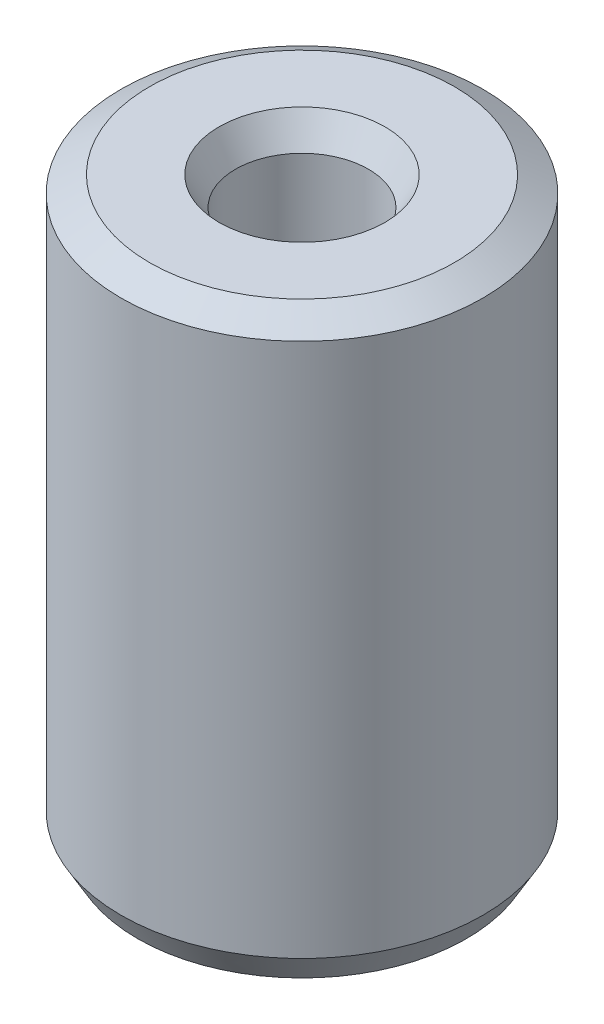
ISO-10303-21;
HEADER;
FILE_DESCRIPTION(('STEP AP214'),'2;1');
FILE_NAME('part.step','',(''),(''),'','','');
FILE_SCHEMA(('AUTOMOTIVE_DESIGN { 1 0 10303 214 1 1 1 1 }'));
ENDSEC;
DATA;
#1=APPLICATION_CONTEXT('core data for automotive mechanical design processes');
#2=APPLICATION_PROTOCOL_DEFINITION('international standard','automotive_design',2000,#1);
#3=PRODUCT_CONTEXT('',#1,'mechanical');
#4=PRODUCT('Part','Part','',(#3));
#5=PRODUCT_RELATED_PRODUCT_CATEGORY('part','',(#4));
#6=PRODUCT_DEFINITION_FORMATION('','',#4);
#7=PRODUCT_DEFINITION_CONTEXT('part definition',#1,'design');
#8=PRODUCT_DEFINITION('design','',#6,#7);
#9=PRODUCT_DEFINITION_SHAPE('','',#8);
#10=(LENGTH_UNIT() NAMED_UNIT(*) SI_UNIT(.MILLI.,.METRE.));
#11=(NAMED_UNIT(*) PLANE_ANGLE_UNIT() SI_UNIT($,.RADIAN.));
#12=(NAMED_UNIT(*) SI_UNIT($,.STERADIAN.) SOLID_ANGLE_UNIT());
#13=UNCERTAINTY_MEASURE_WITH_UNIT(LENGTH_MEASURE(1.E-05),#10,'distance_accuracy_value','');
#14=(GEOMETRIC_REPRESENTATION_CONTEXT(3) GLOBAL_UNCERTAINTY_ASSIGNED_CONTEXT((#13)) GLOBAL_UNIT_ASSIGNED_CONTEXT((#10,
#11,#12)) REPRESENTATION_CONTEXT('',''));
#15=CARTESIAN_POINT('',(0.,0.,0.));
#16=DIRECTION('',(0.,0.,1.));
#17=DIRECTION('',(1.,0.,0.));
#18=AXIS2_PLACEMENT_3D('',#15,#16,#17);
#19=CARTESIAN_POINT('',(0.,64.048340345503,0.));
#20=DIRECTION('',(0.,-1.,0.));
#21=DIRECTION('',(0.,0.,-1.));
#22=AXIS2_PLACEMENT_3D('',#19,#20,#21);
#23=CYLINDRICAL_SURFACE('',#22,20.);
#24=CARTESIAN_POINT('',(0.,3.14994997063316,0.));
#25=DIRECTION('',(0.,1.,0.));
#26=DIRECTION('',(0.,0.,1.));
#27=AXIS2_PLACEMENT_3D('',#24,#25,#26);
#28=CIRCLE('',#27,20.);
#29=CARTESIAN_POINT('',(0.,3.14994997063316,20.));
#30=VERTEX_POINT('',#29);
#31=EDGE_CURVE('E10',#30,#30,#28,.T.);
#32=ORIENTED_EDGE('',*,*,#31,.T.);
#33=EDGE_LOOP('',(#32));
#34=FACE_BOUND('',#33,.T.);
#35=CARTESIAN_POINT('',(0.,62.2297158820241,0.));
#36=DIRECTION('',(0.,1.,0.));
#37=DIRECTION('',(0.,0.,1.));
#38=AXIS2_PLACEMENT_3D('',#35,#36,#37);
#39=CIRCLE('',#38,20.);
#40=CARTESIAN_POINT('',(0.,62.2297158820241,20.));
#41=VERTEX_POINT('',#40);
#42=EDGE_CURVE('E50',#41,#41,#39,.F.);
#43=ORIENTED_EDGE('',*,*,#42,.T.);
#44=EDGE_LOOP('',(#43));
#45=FACE_BOUND('',#44,.T.);
#46=ADVANCED_FACE('F39',(#34,#45),#23,.T.);
#47=CARTESIAN_POINT('',(0.,64.048340345503,0.));
#48=DIRECTION('',(0.,1.,0.));
#49=DIRECTION('',(0.,0.,1.));
#50=AXIS2_PLACEMENT_3D('',#47,#48,#49);
#51=PLANE('',#50);
#52=CARTESIAN_POINT('',(0.,64.048340345503,0.));
#53=DIRECTION('',(0.,1.,0.));
#54=DIRECTION('',(0.,0.,1.));
#55=AXIS2_PLACEMENT_3D('',#52,#53,#54);
#56=CIRCLE('',#55,9.16646213930193);
#57=CARTESIAN_POINT('',(0.,64.048340345503,9.16646213930193));
#58=VERTEX_POINT('',#57);
#59=EDGE_CURVE('E58',#58,#58,#56,.F.);
#60=ORIENTED_EDGE('',*,*,#59,.T.);
#61=EDGE_LOOP('',(#60));
#62=FACE_BOUND('',#61,.T.);
#63=CARTESIAN_POINT('',(0.,64.048340345503,0.));
#64=DIRECTION('',(0.,1.,0.));
#65=DIRECTION('',(0.,0.,1.));
#66=AXIS2_PLACEMENT_3D('',#63,#64,#65);
#67=CIRCLE('',#66,16.8500500293668);
#68=CARTESIAN_POINT('',(0.,64.048340345503,16.8500500293668));
#69=VERTEX_POINT('',#68);
#70=EDGE_CURVE('E61',#69,#69,#67,.T.);
#71=ORIENTED_EDGE('',*,*,#70,.T.);
#72=EDGE_LOOP('',(#71));
#73=FACE_BOUND('',#72,.T.);
#74=ADVANCED_FACE('F88',(#62,#73),#51,.T.);
#75=CARTESIAN_POINT('',(0.,0.,0.));
#76=DIRECTION('',(0.,1.,0.));
#77=DIRECTION('',(0.,0.,1.));
#78=AXIS2_PLACEMENT_3D('',#75,#76,#77);
#79=PLANE('',#78);
#80=CARTESIAN_POINT('',(0.,0.,0.));
#81=DIRECTION('',(0.,1.,0.));
#82=DIRECTION('',(0.,0.,1.));
#83=AXIS2_PLACEMENT_3D('',#80,#81,#82);
#84=CIRCLE('',#83,10.4977876464562);
#85=CARTESIAN_POINT('',(0.,0.,10.4977876464562));
#86=VERTEX_POINT('',#85);
#87=EDGE_CURVE('E51',#86,#86,#84,.T.);
#88=ORIENTED_EDGE('',*,*,#87,.T.);
#89=EDGE_LOOP('',(#88));
#90=FACE_BOUND('',#89,.T.);
#91=CARTESIAN_POINT('',(0.,0.,0.));
#92=DIRECTION('',(0.,1.,0.));
#93=DIRECTION('',(0.,0.,1.));
#94=AXIS2_PLACEMENT_3D('',#91,#92,#93);
#95=CIRCLE('',#94,18.1813755365211);
#96=CARTESIAN_POINT('',(0.,0.,18.1813755365211));
#97=VERTEX_POINT('',#96);
#98=EDGE_CURVE('E54',#97,#97,#95,.F.);
#99=ORIENTED_EDGE('',*,*,#98,.T.);
#100=EDGE_LOOP('',(#99));
#101=FACE_BOUND('',#100,.T.);
#102=ADVANCED_FACE('F83',(#90,#101),#79,.F.);
#103=CARTESIAN_POINT('',(0.,64.048340345503,0.));
#104=DIRECTION('',(0.,-1.,0.));
#105=DIRECTION('',(0.,0.,-1.));
#106=AXIS2_PLACEMENT_3D('',#103,#104,#105);
#107=CYLINDRICAL_SURFACE('',#106,7.34783767582298);
#108=CARTESIAN_POINT('',(0.,60.8983903748698,0.));
#109=DIRECTION('',(0.,1.,0.));
#110=DIRECTION('',(0.,0.,1.));
#111=AXIS2_PLACEMENT_3D('',#108,#109,#110);
#112=CIRCLE('',#111,7.34783767582298);
#113=CARTESIAN_POINT('',(0.,60.8983903748698,7.34783767582298));
#114=VERTEX_POINT('',#113);
#115=EDGE_CURVE('E67',#114,#114,#112,.T.);
#116=ORIENTED_EDGE('',*,*,#115,.T.);
#117=EDGE_LOOP('',(#116));
#118=FACE_BOUND('',#117,.T.);
#119=CARTESIAN_POINT('',(0.,1.81862446347894,0.));
#120=DIRECTION('',(0.,1.,0.));
#121=DIRECTION('',(0.,0.,1.));
#122=AXIS2_PLACEMENT_3D('',#119,#120,#121);
#123=CIRCLE('',#122,7.34783767582298);
#124=CARTESIAN_POINT('',(0.,1.81862446347894,7.34783767582298));
#125=VERTEX_POINT('',#124);
#126=EDGE_CURVE('E69',#125,#125,#123,.F.);
#127=ORIENTED_EDGE('',*,*,#126,.T.);
#128=EDGE_LOOP('',(#127));
#129=FACE_BOUND('',#128,.T.);
#130=ADVANCED_FACE('F71',(#118,#129),#107,.F.);
#131=CARTESIAN_POINT('',(0.,60.8983903748698,0.));
#132=DIRECTION('',(0.,1.,0.));
#133=DIRECTION('',(0.,0.,1.));
#134=AXIS2_PLACEMENT_3D('',#131,#132,#133);
#135=CONICAL_SURFACE('',#134,7.34783767582298,0.5235987755983);
#136=ORIENTED_EDGE('',*,*,#59,.F.);
#137=EDGE_LOOP('',(#136));
#138=FACE_BOUND('',#137,.T.);
#139=ORIENTED_EDGE('',*,*,#115,.F.);
#140=EDGE_LOOP('',(#139));
#141=FACE_BOUND('',#140,.T.);
#142=ADVANCED_FACE('F77',(#138,#141),#135,.F.);
#143=CARTESIAN_POINT('',(0.,0.,0.));
#144=DIRECTION('',(0.,-1.,0.));
#145=DIRECTION('',(0.,0.,-1.));
#146=AXIS2_PLACEMENT_3D('',#143,#144,#145);
#147=CONICAL_SURFACE('',#146,10.4977876464562,1.0471975511966);
#148=ORIENTED_EDGE('',*,*,#126,.F.);
#149=EDGE_LOOP('',(#148));
#150=FACE_BOUND('',#149,.T.);
#151=ORIENTED_EDGE('',*,*,#87,.F.);
#152=EDGE_LOOP('',(#151));
#153=FACE_BOUND('',#152,.T.);
#154=ADVANCED_FACE('F73',(#150,#153),#147,.F.);
#155=CARTESIAN_POINT('',(0.,3.14994997063316,0.));
#156=DIRECTION('',(0.,1.,0.));
#157=DIRECTION('',(0.,0.,1.));
#158=AXIS2_PLACEMENT_3D('',#155,#156,#157);
#159=CONICAL_SURFACE('',#158,20.,0.523598775598304);
#160=ORIENTED_EDGE('',*,*,#98,.F.);
#161=EDGE_LOOP('',(#160));
#162=FACE_BOUND('',#161,.T.);
#163=ORIENTED_EDGE('',*,*,#31,.F.);
#164=EDGE_LOOP('',(#163));
#165=FACE_BOUND('',#164,.T.);
#166=ADVANCED_FACE('F76',(#162,#165),#159,.T.);
#167=CARTESIAN_POINT('',(0.,64.048340345503,0.));
#168=DIRECTION('',(0.,-1.,0.));
#169=DIRECTION('',(0.,0.,-1.));
#170=AXIS2_PLACEMENT_3D('',#167,#168,#169);
#171=CONICAL_SURFACE('',#170,16.8500500293668,1.0471975511966);
#172=ORIENTED_EDGE('',*,*,#42,.F.);
#173=EDGE_LOOP('',(#172));
#174=FACE_BOUND('',#173,.T.);
#175=ORIENTED_EDGE('',*,*,#70,.F.);
#176=EDGE_LOOP('',(#175));
#177=FACE_BOUND('',#176,.T.);
#178=ADVANCED_FACE('F45',(#174,#177),#171,.T.);
#179=CLOSED_SHELL('',(#46,#74,#102,#130,#142,#154,#166,#178));
#180=MANIFOLD_SOLID_BREP('B2',#179);
#181=ADVANCED_BREP_SHAPE_REPRESENTATION('',(#18,#180),#14);
#182=SHAPE_DEFINITION_REPRESENTATION(#9,#181);
ENDSEC;
END-ISO-10303-21;
